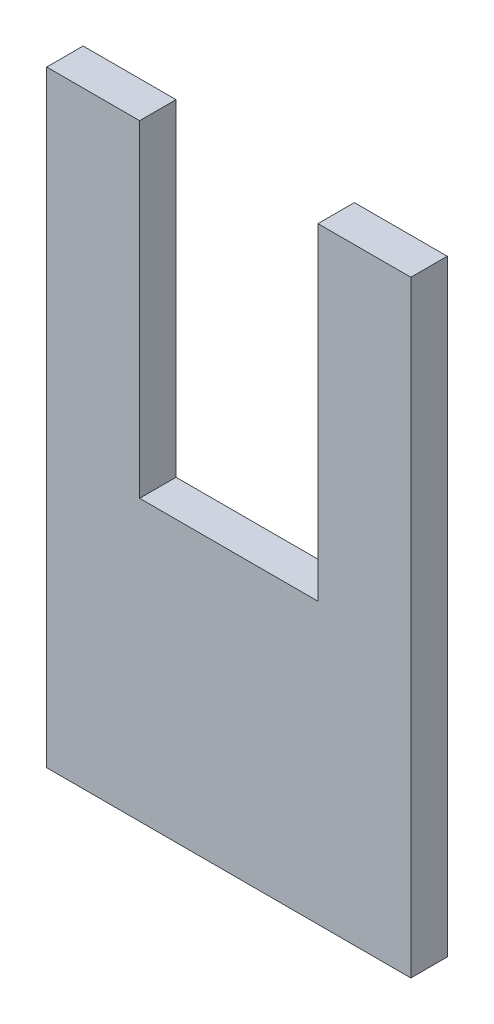
ISO-10303-21;
HEADER;
FILE_DESCRIPTION(('STEP AP214'),'2;1');
FILE_NAME('part.step','',(''),(''),'','','');
FILE_SCHEMA(('AUTOMOTIVE_DESIGN { 1 0 10303 214 1 1 1 1 }'));
ENDSEC;
DATA;
#1=APPLICATION_CONTEXT('core data for automotive mechanical design processes');
#2=APPLICATION_PROTOCOL_DEFINITION('international standard','automotive_design',2000,#1);
#3=PRODUCT_CONTEXT('',#1,'mechanical');
#4=PRODUCT('Part','Part','',(#3));
#5=PRODUCT_RELATED_PRODUCT_CATEGORY('part','',(#4));
#6=PRODUCT_DEFINITION_FORMATION('','',#4);
#7=PRODUCT_DEFINITION_CONTEXT('part definition',#1,'design');
#8=PRODUCT_DEFINITION('design','',#6,#7);
#9=PRODUCT_DEFINITION_SHAPE('','',#8);
#10=(LENGTH_UNIT() NAMED_UNIT(*) SI_UNIT(.MILLI.,.METRE.));
#11=(NAMED_UNIT(*) PLANE_ANGLE_UNIT() SI_UNIT($,.RADIAN.));
#12=(NAMED_UNIT(*) SI_UNIT($,.STERADIAN.) SOLID_ANGLE_UNIT());
#13=UNCERTAINTY_MEASURE_WITH_UNIT(LENGTH_MEASURE(1.E-05),#10,'distance_accuracy_value','');
#14=(GEOMETRIC_REPRESENTATION_CONTEXT(3) GLOBAL_UNCERTAINTY_ASSIGNED_CONTEXT((#13)) GLOBAL_UNIT_ASSIGNED_CONTEXT((#10,
#11,#12)) REPRESENTATION_CONTEXT('',''));
#15=CARTESIAN_POINT('',(0.,0.,0.));
#16=DIRECTION('',(0.,0.,1.));
#17=DIRECTION('',(1.,0.,0.));
#18=AXIS2_PLACEMENT_3D('',#15,#16,#17);
#19=CARTESIAN_POINT('',(-78.1703964092676,43.9701889020071,3.));
#20=DIRECTION('',(1.,0.,0.));
#21=DIRECTION('',(0.,1.,0.));
#22=AXIS2_PLACEMENT_3D('',#19,#20,#21);
#23=PLANE('',#22);
#24=DIRECTION('',(0.,-1.,0.));
#25=VECTOR('',#24,1.);
#26=CARTESIAN_POINT('',(-78.1703964092676,43.9701889020071,0.));
#27=LINE('',#26,#25);
#28=CARTESIAN_POINT('',(-78.1703964092676,43.9701889020071,0.));
#29=VERTEX_POINT('',#28);
#30=CARTESIAN_POINT('',(-78.1703964092676,-6.02981109799292,0.));
#31=VERTEX_POINT('',#30);
#32=EDGE_CURVE('E131',#29,#31,#27,.T.);
#33=ORIENTED_EDGE('',*,*,#32,.T.);
#34=DIRECTION('',(0.,0.,-1.));
#35=VECTOR('',#34,1.);
#36=CARTESIAN_POINT('',(-78.1703964092676,-6.02981109799292,3.));
#37=LINE('',#36,#35);
#38=CARTESIAN_POINT('',(-78.1703964092676,-6.02981109799292,3.));
#39=VERTEX_POINT('',#38);
#40=EDGE_CURVE('E11',#39,#31,#37,.T.);
#41=ORIENTED_EDGE('',*,*,#40,.F.);
#42=DIRECTION('',(0.,-1.,0.));
#43=VECTOR('',#42,1.);
#44=CARTESIAN_POINT('',(-78.1703964092676,43.9701889020071,3.));
#45=LINE('',#44,#43);
#46=CARTESIAN_POINT('',(-78.1703964092676,43.9701889020071,3.));
#47=VERTEX_POINT('',#46);
#48=EDGE_CURVE('E145',#47,#39,#45,.T.);
#49=ORIENTED_EDGE('',*,*,#48,.F.);
#50=DIRECTION('',(0.,0.,-1.));
#51=VECTOR('',#50,1.);
#52=CARTESIAN_POINT('',(-78.1703964092676,43.9701889020071,3.));
#53=LINE('',#52,#51);
#54=EDGE_CURVE('E127',#47,#29,#53,.T.);
#55=ORIENTED_EDGE('',*,*,#54,.T.);
#56=EDGE_LOOP('',(#33,#41,#49,#55));
#57=FACE_BOUND('',#56,.T.);
#58=ADVANCED_FACE('F35',(#57),#23,.F.);
#59=CARTESIAN_POINT('',(-78.1703964092676,-6.02981109799292,3.));
#60=DIRECTION('',(0.,1.,0.));
#61=DIRECTION('',(0.,0.,1.));
#62=AXIS2_PLACEMENT_3D('',#59,#60,#61);
#63=PLANE('',#62);
#64=DIRECTION('',(1.,0.,0.));
#65=VECTOR('',#64,1.);
#66=CARTESIAN_POINT('',(-78.1703964092676,-6.02981109799292,0.));
#67=LINE('',#66,#65);
#68=CARTESIAN_POINT('',(-48.1703964092676,-6.02981109799292,0.));
#69=VERTEX_POINT('',#68);
#70=EDGE_CURVE('E134',#31,#69,#67,.T.);
#71=ORIENTED_EDGE('',*,*,#70,.T.);
#72=DIRECTION('',(0.,0.,-1.));
#73=VECTOR('',#72,1.);
#74=CARTESIAN_POINT('',(-48.1703964092676,-6.02981109799292,3.));
#75=LINE('',#74,#73);
#76=CARTESIAN_POINT('',(-48.1703964092676,-6.02981109799292,3.));
#77=VERTEX_POINT('',#76);
#78=EDGE_CURVE('E43',#77,#69,#75,.T.);
#79=ORIENTED_EDGE('',*,*,#78,.F.);
#80=DIRECTION('',(1.,0.,0.));
#81=VECTOR('',#80,1.);
#82=CARTESIAN_POINT('',(-78.1703964092676,-6.02981109799292,3.));
#83=LINE('',#82,#81);
#84=EDGE_CURVE('E94',#39,#77,#83,.T.);
#85=ORIENTED_EDGE('',*,*,#84,.F.);
#86=ORIENTED_EDGE('',*,*,#40,.T.);
#87=EDGE_LOOP('',(#71,#79,#85,#86));
#88=FACE_BOUND('',#87,.T.);
#89=ADVANCED_FACE('F180',(#88),#63,.F.);
#90=CARTESIAN_POINT('',(-48.1703964092676,43.9701889020071,3.));
#91=DIRECTION('',(-1.,0.,0.));
#92=DIRECTION('',(0.,-1.,0.));
#93=AXIS2_PLACEMENT_3D('',#90,#91,#92);
#94=PLANE('',#93);
#95=DIRECTION('',(0.,1.,0.));
#96=VECTOR('',#95,1.);
#97=CARTESIAN_POINT('',(-48.1703964092676,43.9701889020071,0.));
#98=LINE('',#97,#96);
#99=CARTESIAN_POINT('',(-48.1703964092676,43.9701889020071,0.));
#100=VERTEX_POINT('',#99);
#101=EDGE_CURVE('E136',#69,#100,#98,.T.);
#102=ORIENTED_EDGE('',*,*,#101,.T.);
#103=DIRECTION('',(0.,0.,-1.));
#104=VECTOR('',#103,1.);
#105=CARTESIAN_POINT('',(-48.1703964092676,43.9701889020071,3.));
#106=LINE('',#105,#104);
#107=CARTESIAN_POINT('',(-48.1703964092676,43.9701889020071,3.));
#108=VERTEX_POINT('',#107);
#109=EDGE_CURVE('E152',#108,#100,#106,.T.);
#110=ORIENTED_EDGE('',*,*,#109,.F.);
#111=DIRECTION('',(0.,1.,0.));
#112=VECTOR('',#111,1.);
#113=CARTESIAN_POINT('',(-48.1703964092676,43.9701889020071,3.));
#114=LINE('',#113,#112);
#115=EDGE_CURVE('E160',#77,#108,#114,.T.);
#116=ORIENTED_EDGE('',*,*,#115,.F.);
#117=ORIENTED_EDGE('',*,*,#78,.T.);
#118=EDGE_LOOP('',(#102,#110,#116,#117));
#119=FACE_BOUND('',#118,.T.);
#120=ADVANCED_FACE('F158',(#119),#94,.F.);
#121=CARTESIAN_POINT('',(-55.8241835925379,43.9701889020071,3.));
#122=DIRECTION('',(0.,-1.,0.));
#123=DIRECTION('',(0.,0.,-1.));
#124=AXIS2_PLACEMENT_3D('',#121,#122,#123);
#125=PLANE('',#124);
#126=DIRECTION('',(-1.,0.,0.));
#127=VECTOR('',#126,1.);
#128=CARTESIAN_POINT('',(-55.8241835925379,43.9701889020071,0.));
#129=LINE('',#128,#127);
#130=CARTESIAN_POINT('',(-55.8241835925379,43.9701889020071,0.));
#131=VERTEX_POINT('',#130);
#132=EDGE_CURVE('E138',#100,#131,#129,.T.);
#133=ORIENTED_EDGE('',*,*,#132,.T.);
#134=DIRECTION('',(0.,0.,-1.));
#135=VECTOR('',#134,1.);
#136=CARTESIAN_POINT('',(-55.8241835925379,43.9701889020071,3.));
#137=LINE('',#136,#135);
#138=CARTESIAN_POINT('',(-55.8241835925379,43.9701889020071,3.));
#139=VERTEX_POINT('',#138);
#140=EDGE_CURVE('E149',#139,#131,#137,.T.);
#141=ORIENTED_EDGE('',*,*,#140,.F.);
#142=DIRECTION('',(-1.,0.,0.));
#143=VECTOR('',#142,1.);
#144=CARTESIAN_POINT('',(-55.8241835925379,43.9701889020071,3.));
#145=LINE('',#144,#143);
#146=EDGE_CURVE('E172',#108,#139,#145,.T.);
#147=ORIENTED_EDGE('',*,*,#146,.F.);
#148=ORIENTED_EDGE('',*,*,#109,.T.);
#149=EDGE_LOOP('',(#133,#141,#147,#148));
#150=FACE_BOUND('',#149,.T.);
#151=ADVANCED_FACE('F168',(#150),#125,.F.);
#152=CARTESIAN_POINT('',(-55.8241835925379,43.9701889020071,3.));
#153=DIRECTION('',(1.,0.,0.));
#154=DIRECTION('',(0.,0.,-1.));
#155=AXIS2_PLACEMENT_3D('',#152,#153,#154);
#156=PLANE('',#155);
#157=DIRECTION('',(0.,-1.,0.));
#158=VECTOR('',#157,1.);
#159=CARTESIAN_POINT('',(-55.8241835925379,43.9701889020071,0.));
#160=LINE('',#159,#158);
#161=CARTESIAN_POINT('',(-55.8241835925379,17.0252601953464,0.));
#162=VERTEX_POINT('',#161);
#163=EDGE_CURVE('E140',#131,#162,#160,.T.);
#164=ORIENTED_EDGE('',*,*,#163,.T.);
#165=DIRECTION('',(0.,0.,-1.));
#166=VECTOR('',#165,1.);
#167=CARTESIAN_POINT('',(-55.8241835925379,17.0252601953464,3.));
#168=LINE('',#167,#166);
#169=CARTESIAN_POINT('',(-55.8241835925379,17.0252601953464,3.));
#170=VERTEX_POINT('',#169);
#171=EDGE_CURVE('E122',#170,#162,#168,.T.);
#172=ORIENTED_EDGE('',*,*,#171,.F.);
#173=DIRECTION('',(0.,-1.,0.));
#174=VECTOR('',#173,1.);
#175=CARTESIAN_POINT('',(-55.8241835925379,43.9701889020071,3.));
#176=LINE('',#175,#174);
#177=EDGE_CURVE('E113',#139,#170,#176,.T.);
#178=ORIENTED_EDGE('',*,*,#177,.F.);
#179=ORIENTED_EDGE('',*,*,#140,.T.);
#180=EDGE_LOOP('',(#164,#172,#178,#179));
#181=FACE_BOUND('',#180,.T.);
#182=ADVANCED_FACE('F171',(#181),#156,.F.);
#183=CARTESIAN_POINT('',(-70.5166092259972,17.0252601953464,3.));
#184=DIRECTION('',(0.,-1.,0.));
#185=DIRECTION('',(0.,0.,-1.));
#186=AXIS2_PLACEMENT_3D('',#183,#184,#185);
#187=PLANE('',#186);
#188=DIRECTION('',(-1.,0.,0.));
#189=VECTOR('',#188,1.);
#190=CARTESIAN_POINT('',(-70.5166092259972,17.0252601953464,0.));
#191=LINE('',#190,#189);
#192=CARTESIAN_POINT('',(-70.5166092259972,17.0252601953464,0.));
#193=VERTEX_POINT('',#192);
#194=EDGE_CURVE('E121',#162,#193,#191,.T.);
#195=ORIENTED_EDGE('',*,*,#194,.T.);
#196=DIRECTION('',(0.,0.,-1.));
#197=VECTOR('',#196,1.);
#198=CARTESIAN_POINT('',(-70.5166092259972,17.0252601953464,3.));
#199=LINE('',#198,#197);
#200=CARTESIAN_POINT('',(-70.5166092259972,17.0252601953464,3.));
#201=VERTEX_POINT('',#200);
#202=EDGE_CURVE('E118',#201,#193,#199,.T.);
#203=ORIENTED_EDGE('',*,*,#202,.F.);
#204=DIRECTION('',(-1.,0.,0.));
#205=VECTOR('',#204,1.);
#206=CARTESIAN_POINT('',(-70.5166092259972,17.0252601953464,3.));
#207=LINE('',#206,#205);
#208=EDGE_CURVE('E107',#170,#201,#207,.T.);
#209=ORIENTED_EDGE('',*,*,#208,.F.);
#210=ORIENTED_EDGE('',*,*,#171,.T.);
#211=EDGE_LOOP('',(#195,#203,#209,#210));
#212=FACE_BOUND('',#211,.T.);
#213=ADVANCED_FACE('F119',(#212),#187,.F.);
#214=CARTESIAN_POINT('',(-70.5166092259972,43.9701889020071,3.));
#215=DIRECTION('',(-1.,0.,0.));
#216=DIRECTION('',(0.,0.,1.));
#217=AXIS2_PLACEMENT_3D('',#214,#215,#216);
#218=PLANE('',#217);
#219=DIRECTION('',(0.,1.,0.));
#220=VECTOR('',#219,1.);
#221=CARTESIAN_POINT('',(-70.5166092259972,43.9701889020071,0.));
#222=LINE('',#221,#220);
#223=CARTESIAN_POINT('',(-70.5166092259972,43.9701889020071,0.));
#224=VERTEX_POINT('',#223);
#225=EDGE_CURVE('E80',#193,#224,#222,.T.);
#226=ORIENTED_EDGE('',*,*,#225,.T.);
#227=DIRECTION('',(0.,0.,-1.));
#228=VECTOR('',#227,1.);
#229=CARTESIAN_POINT('',(-70.5166092259972,43.9701889020071,3.));
#230=LINE('',#229,#228);
#231=CARTESIAN_POINT('',(-70.5166092259972,43.9701889020071,3.));
#232=VERTEX_POINT('',#231);
#233=EDGE_CURVE('E123',#232,#224,#230,.T.);
#234=ORIENTED_EDGE('',*,*,#233,.F.);
#235=DIRECTION('',(0.,1.,0.));
#236=VECTOR('',#235,1.);
#237=CARTESIAN_POINT('',(-70.5166092259972,43.9701889020071,3.));
#238=LINE('',#237,#236);
#239=EDGE_CURVE('E111',#201,#232,#238,.T.);
#240=ORIENTED_EDGE('',*,*,#239,.F.);
#241=ORIENTED_EDGE('',*,*,#202,.T.);
#242=EDGE_LOOP('',(#226,#234,#240,#241));
#243=FACE_BOUND('',#242,.T.);
#244=ADVANCED_FACE('F125',(#243),#218,.F.);
#245=CARTESIAN_POINT('',(-78.1703964092676,43.9701889020071,3.));
#246=DIRECTION('',(0.,-1.,0.));
#247=DIRECTION('',(0.,0.,-1.));
#248=AXIS2_PLACEMENT_3D('',#245,#246,#247);
#249=PLANE('',#248);
#250=DIRECTION('',(-1.,0.,0.));
#251=VECTOR('',#250,1.);
#252=CARTESIAN_POINT('',(-78.1703964092676,43.9701889020071,0.));
#253=LINE('',#252,#251);
#254=EDGE_CURVE('E86',#224,#29,#253,.T.);
#255=ORIENTED_EDGE('',*,*,#254,.T.);
#256=ORIENTED_EDGE('',*,*,#54,.F.);
#257=DIRECTION('',(-1.,0.,0.));
#258=VECTOR('',#257,1.);
#259=CARTESIAN_POINT('',(-78.1703964092676,43.9701889020071,3.));
#260=LINE('',#259,#258);
#261=EDGE_CURVE('E51',#232,#47,#260,.T.);
#262=ORIENTED_EDGE('',*,*,#261,.F.);
#263=ORIENTED_EDGE('',*,*,#233,.T.);
#264=EDGE_LOOP('',(#255,#256,#262,#263));
#265=FACE_BOUND('',#264,.T.);
#266=ADVANCED_FACE('F196',(#265),#249,.F.);
#267=CARTESIAN_POINT('',(0.,0.,3.));
#268=DIRECTION('',(0.,0.,1.));
#269=DIRECTION('',(1.,0.,0.));
#270=AXIS2_PLACEMENT_3D('',#267,#268,#269);
#271=PLANE('',#270);
#272=ORIENTED_EDGE('',*,*,#48,.T.);
#273=ORIENTED_EDGE('',*,*,#84,.T.);
#274=ORIENTED_EDGE('',*,*,#115,.T.);
#275=ORIENTED_EDGE('',*,*,#146,.T.);
#276=ORIENTED_EDGE('',*,*,#177,.T.);
#277=ORIENTED_EDGE('',*,*,#208,.T.);
#278=ORIENTED_EDGE('',*,*,#239,.T.);
#279=ORIENTED_EDGE('',*,*,#261,.T.);
#280=EDGE_LOOP('',(#272,#273,#274,#275,#276,#277,#278,#279));
#281=FACE_BOUND('',#280,.T.);
#282=ADVANCED_FACE('F109',(#281),#271,.T.);
#283=CARTESIAN_POINT('',(0.,0.,0.));
#284=DIRECTION('',(0.,0.,1.));
#285=DIRECTION('',(1.,0.,0.));
#286=AXIS2_PLACEMENT_3D('',#283,#284,#285);
#287=PLANE('',#286);
#288=ORIENTED_EDGE('',*,*,#32,.F.);
#289=ORIENTED_EDGE('',*,*,#254,.F.);
#290=ORIENTED_EDGE('',*,*,#225,.F.);
#291=ORIENTED_EDGE('',*,*,#194,.F.);
#292=ORIENTED_EDGE('',*,*,#163,.F.);
#293=ORIENTED_EDGE('',*,*,#132,.F.);
#294=ORIENTED_EDGE('',*,*,#101,.F.);
#295=ORIENTED_EDGE('',*,*,#70,.F.);
#296=EDGE_LOOP('',(#288,#289,#290,#291,#292,#293,#294,#295));
#297=FACE_BOUND('',#296,.T.);
#298=ADVANCED_FACE('F164',(#297),#287,.F.);
#299=CLOSED_SHELL('',(#58,#89,#120,#151,#182,#213,#244,#266,#282,#298));
#300=MANIFOLD_SOLID_BREP('B2',#299);
#301=ADVANCED_BREP_SHAPE_REPRESENTATION('',(#18,#300),#14);
#302=SHAPE_DEFINITION_REPRESENTATION(#9,#301);
ENDSEC;
END-ISO-10303-21;
